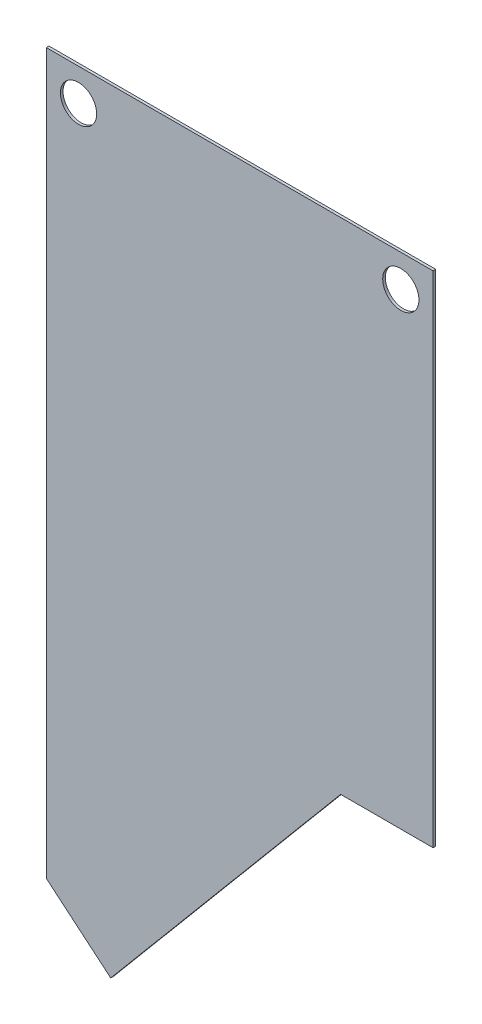
ISO-10303-21;
HEADER;
FILE_DESCRIPTION(('STEP AP214'),'2;1');
FILE_NAME('part.step','',(''),(''),'','','');
FILE_SCHEMA(('AUTOMOTIVE_DESIGN { 1 0 10303 214 1 1 1 1 }'));
ENDSEC;
DATA;
#1=APPLICATION_CONTEXT('core data for automotive mechanical design processes');
#2=APPLICATION_PROTOCOL_DEFINITION('international standard','automotive_design',2000,#1);
#3=PRODUCT_CONTEXT('',#1,'mechanical');
#4=PRODUCT('Part','Part','',(#3));
#5=PRODUCT_RELATED_PRODUCT_CATEGORY('part','',(#4));
#6=PRODUCT_DEFINITION_FORMATION('','',#4);
#7=PRODUCT_DEFINITION_CONTEXT('part definition',#1,'design');
#8=PRODUCT_DEFINITION('design','',#6,#7);
#9=PRODUCT_DEFINITION_SHAPE('','',#8);
#10=(LENGTH_UNIT() NAMED_UNIT(*) SI_UNIT(.MILLI.,.METRE.));
#11=(NAMED_UNIT(*) PLANE_ANGLE_UNIT() SI_UNIT($,.RADIAN.));
#12=(NAMED_UNIT(*) SI_UNIT($,.STERADIAN.) SOLID_ANGLE_UNIT());
#13=UNCERTAINTY_MEASURE_WITH_UNIT(LENGTH_MEASURE(1.E-05),#10,'distance_accuracy_value','');
#14=(GEOMETRIC_REPRESENTATION_CONTEXT(3) GLOBAL_UNCERTAINTY_ASSIGNED_CONTEXT((#13)) GLOBAL_UNIT_ASSIGNED_CONTEXT((#10,
#11,#12)) REPRESENTATION_CONTEXT('',''));
#15=CARTESIAN_POINT('',(0.,0.,0.));
#16=DIRECTION('',(0.,0.,1.));
#17=DIRECTION('',(1.,0.,0.));
#18=AXIS2_PLACEMENT_3D('',#15,#16,#17);
#19=CARTESIAN_POINT('',(-50.8,0.,2.1082));
#20=DIRECTION('',(1.,0.,0.));
#21=DIRECTION('',(0.,0.,-1.));
#22=AXIS2_PLACEMENT_3D('',#19,#20,#21);
#23=PLANE('',#22);
#24=DIRECTION('',(0.,-1.,0.));
#25=VECTOR('',#24,1.);
#26=CARTESIAN_POINT('',(-50.8,0.,0.));
#27=LINE('',#26,#25);
#28=CARTESIAN_POINT('',(-50.8,0.,0.));
#29=VERTEX_POINT('',#28);
#30=CARTESIAN_POINT('',(-50.8,-566.973738736194,0.));
#31=VERTEX_POINT('',#30);
#32=EDGE_CURVE('E81',#29,#31,#27,.T.);
#33=ORIENTED_EDGE('',*,*,#32,.T.);
#34=DIRECTION('',(0.,0.,-1.));
#35=VECTOR('',#34,1.);
#36=CARTESIAN_POINT('',(-50.8000000000001,-566.973738736194,2.1082));
#37=LINE('',#36,#35);
#38=CARTESIAN_POINT('',(-50.8000000000001,-566.973738736194,2.1082));
#39=VERTEX_POINT('',#38);
#40=EDGE_CURVE('E47',#39,#31,#37,.T.);
#41=ORIENTED_EDGE('',*,*,#40,.F.);
#42=DIRECTION('',(0.,-1.,0.));
#43=VECTOR('',#42,1.);
#44=CARTESIAN_POINT('',(-50.8,0.,2.1082));
#45=LINE('',#44,#43);
#46=CARTESIAN_POINT('',(-50.8,0.,2.1082));
#47=VERTEX_POINT('',#46);
#48=EDGE_CURVE('E76',#47,#39,#45,.T.);
#49=ORIENTED_EDGE('',*,*,#48,.F.);
#50=DIRECTION('',(0.,0.,-1.));
#51=VECTOR('',#50,1.);
#52=CARTESIAN_POINT('',(-50.8,0.,2.1082));
#53=LINE('',#52,#51);
#54=EDGE_CURVE('E40',#47,#29,#53,.T.);
#55=ORIENTED_EDGE('',*,*,#54,.T.);
#56=EDGE_LOOP('',(#33,#41,#49,#55));
#57=FACE_BOUND('',#56,.T.);
#58=ADVANCED_FACE('F33',(#57),#23,.F.);
#59=CARTESIAN_POINT('',(254.,0.,2.1082));
#60=DIRECTION('',(-1.,0.,0.));
#61=DIRECTION('',(0.,0.,1.));
#62=AXIS2_PLACEMENT_3D('',#59,#60,#61);
#63=PLANE('',#62);
#64=DIRECTION('',(0.,1.,0.));
#65=VECTOR('',#64,1.);
#66=CARTESIAN_POINT('',(254.,0.,2.1082));
#67=LINE('',#66,#65);
#68=CARTESIAN_POINT('',(254.,-393.699999999999,2.1082));
#69=VERTEX_POINT('',#68);
#70=CARTESIAN_POINT('',(254.,0.,2.1082));
#71=VERTEX_POINT('',#70);
#72=EDGE_CURVE('E93',#69,#71,#67,.T.);
#73=ORIENTED_EDGE('',*,*,#72,.F.);
#74=DIRECTION('',(0.,0.,-1.));
#75=VECTOR('',#74,1.);
#76=CARTESIAN_POINT('',(254.,-393.699999999999,2.1082));
#77=LINE('',#76,#75);
#78=CARTESIAN_POINT('',(254.,-393.699999999999,0.));
#79=VERTEX_POINT('',#78);
#80=EDGE_CURVE('E102',#69,#79,#77,.T.);
#81=ORIENTED_EDGE('',*,*,#80,.T.);
#82=DIRECTION('',(0.,1.,0.));
#83=VECTOR('',#82,1.);
#84=CARTESIAN_POINT('',(254.,0.,0.));
#85=LINE('',#84,#83);
#86=CARTESIAN_POINT('',(254.,0.,0.));
#87=VERTEX_POINT('',#86);
#88=EDGE_CURVE('E77',#79,#87,#85,.T.);
#89=ORIENTED_EDGE('',*,*,#88,.T.);
#90=DIRECTION('',(0.,0.,-1.));
#91=VECTOR('',#90,1.);
#92=CARTESIAN_POINT('',(254.,0.,2.1082));
#93=LINE('',#92,#91);
#94=EDGE_CURVE('E11',#71,#87,#93,.T.);
#95=ORIENTED_EDGE('',*,*,#94,.F.);
#96=EDGE_LOOP('',(#73,#81,#89,#95));
#97=FACE_BOUND('',#96,.T.);
#98=ADVANCED_FACE('F156',(#97),#63,.F.);
#99=CARTESIAN_POINT('',(-50.8,0.,2.1082));
#100=DIRECTION('',(0.,-1.,0.));
#101=DIRECTION('',(0.,0.,-1.));
#102=AXIS2_PLACEMENT_3D('',#99,#100,#101);
#103=PLANE('',#102);
#104=DIRECTION('',(-1.,0.,0.));
#105=VECTOR('',#104,1.);
#106=CARTESIAN_POINT('',(-50.8,0.,0.));
#107=LINE('',#106,#105);
#108=EDGE_CURVE('E68',#87,#29,#107,.T.);
#109=ORIENTED_EDGE('',*,*,#108,.T.);
#110=ORIENTED_EDGE('',*,*,#54,.F.);
#111=DIRECTION('',(-1.,0.,0.));
#112=VECTOR('',#111,1.);
#113=CARTESIAN_POINT('',(-50.8,0.,2.1082));
#114=LINE('',#113,#112);
#115=EDGE_CURVE('E56',#71,#47,#114,.T.);
#116=ORIENTED_EDGE('',*,*,#115,.F.);
#117=ORIENTED_EDGE('',*,*,#94,.T.);
#118=EDGE_LOOP('',(#109,#110,#116,#117));
#119=FACE_BOUND('',#118,.T.);
#120=ADVANCED_FACE('F70',(#119),#103,.F.);
#121=CARTESIAN_POINT('',(0.,0.,2.1082));
#122=DIRECTION('',(0.,0.,1.));
#123=DIRECTION('',(1.,0.,0.));
#124=AXIS2_PLACEMENT_3D('',#121,#122,#123);
#125=PLANE('',#124);
#126=DIRECTION('',(1.,0.,0.));
#127=VECTOR('',#126,1.);
#128=CARTESIAN_POINT('',(181.170170025414,-393.7,2.1082));
#129=LINE('',#128,#127);
#130=CARTESIAN_POINT('',(181.170170025414,-393.7,2.1082));
#131=VERTEX_POINT('',#130);
#132=EDGE_CURVE('E107',#131,#69,#129,.T.);
#133=ORIENTED_EDGE('',*,*,#132,.T.);
#134=ORIENTED_EDGE('',*,*,#72,.T.);
#135=ORIENTED_EDGE('',*,*,#115,.T.);
#136=ORIENTED_EDGE('',*,*,#48,.T.);
#137=DIRECTION('',(0.766044443118979,-0.642787609686539,0.));
#138=VECTOR('',#137,1.);
#139=CARTESIAN_POINT('',(-50.8000000000001,-566.973738736194,2.1082));
#140=LINE('',#139,#138);
#141=CARTESIAN_POINT('',(-1.54365409343882E-13,-609.6,2.1082));
#142=VERTEX_POINT('',#141);
#143=EDGE_CURVE('E118',#39,#142,#140,.T.);
#144=ORIENTED_EDGE('',*,*,#143,.T.);
#145=DIRECTION('',(0.642805431535631,0.766029488458695,0.));
#146=VECTOR('',#145,1.);
#147=CARTESIAN_POINT('',(-1.54365409343882E-13,-609.6,2.1082));
#148=LINE('',#147,#146);
#149=EDGE_CURVE('E125',#142,#131,#148,.T.);
#150=ORIENTED_EDGE('',*,*,#149,.T.);
#151=EDGE_LOOP('',(#133,#134,#135,#136,#144,#150));
#152=FACE_BOUND('',#151,.T.);
#153=CARTESIAN_POINT('',(228.6,-25.3999999999994,2.1082));
#154=DIRECTION('',(0.,0.,-1.));
#155=DIRECTION('',(-1.,0.,0.));
#156=AXIS2_PLACEMENT_3D('',#153,#154,#155);
#157=CIRCLE('',#156,14.2875);
#158=CARTESIAN_POINT('',(214.3125,-25.3999999999994,2.1082));
#159=VERTEX_POINT('',#158);
#160=EDGE_CURVE('E97',#159,#159,#157,.T.);
#161=ORIENTED_EDGE('',*,*,#160,.T.);
#162=EDGE_LOOP('',(#161));
#163=FACE_BOUND('',#162,.T.);
#164=CARTESIAN_POINT('',(-25.4,-25.4,2.1082));
#165=DIRECTION('',(0.,0.,-1.));
#166=DIRECTION('',(-1.,0.,0.));
#167=AXIS2_PLACEMENT_3D('',#164,#165,#166);
#168=CIRCLE('',#167,14.2875);
#169=CARTESIAN_POINT('',(-39.6875,-25.4,2.1082));
#170=VERTEX_POINT('',#169);
#171=EDGE_CURVE('E85',#170,#170,#168,.T.);
#172=ORIENTED_EDGE('',*,*,#171,.T.);
#173=EDGE_LOOP('',(#172));
#174=FACE_BOUND('',#173,.T.);
#175=ADVANCED_FACE('F130',(#152,#163,#174),#125,.T.);
#176=CARTESIAN_POINT('',(0.,0.,0.));
#177=DIRECTION('',(0.,0.,1.));
#178=DIRECTION('',(1.,0.,0.));
#179=AXIS2_PLACEMENT_3D('',#176,#177,#178);
#180=PLANE('',#179);
#181=CARTESIAN_POINT('',(228.6,-25.3999999999994,0.));
#182=DIRECTION('',(0.,0.,-1.));
#183=DIRECTION('',(-1.,0.,0.));
#184=AXIS2_PLACEMENT_3D('',#181,#182,#183);
#185=CIRCLE('',#184,14.2875);
#186=CARTESIAN_POINT('',(214.3125,-25.3999999999994,0.));
#187=VERTEX_POINT('',#186);
#188=EDGE_CURVE('E99',#187,#187,#185,.T.);
#189=ORIENTED_EDGE('',*,*,#188,.F.);
#190=EDGE_LOOP('',(#189));
#191=FACE_BOUND('',#190,.T.);
#192=CARTESIAN_POINT('',(-25.4,-25.4,0.));
#193=DIRECTION('',(0.,0.,-1.));
#194=DIRECTION('',(-1.,0.,0.));
#195=AXIS2_PLACEMENT_3D('',#192,#193,#194);
#196=CIRCLE('',#195,14.2875);
#197=CARTESIAN_POINT('',(-39.6875,-25.4,0.));
#198=VERTEX_POINT('',#197);
#199=EDGE_CURVE('E89',#198,#198,#196,.T.);
#200=ORIENTED_EDGE('',*,*,#199,.F.);
#201=EDGE_LOOP('',(#200));
#202=FACE_BOUND('',#201,.T.);
#203=ORIENTED_EDGE('',*,*,#88,.F.);
#204=DIRECTION('',(1.,0.,0.));
#205=VECTOR('',#204,1.);
#206=CARTESIAN_POINT('',(181.170170025414,-393.7,0.));
#207=LINE('',#206,#205);
#208=CARTESIAN_POINT('',(181.170170025414,-393.7,0.));
#209=VERTEX_POINT('',#208);
#210=EDGE_CURVE('E115',#209,#79,#207,.T.);
#211=ORIENTED_EDGE('',*,*,#210,.F.);
#212=DIRECTION('',(0.642805431535631,0.766029488458695,0.));
#213=VECTOR('',#212,1.);
#214=CARTESIAN_POINT('',(-1.54365409343882E-13,-609.6,0.));
#215=LINE('',#214,#213);
#216=CARTESIAN_POINT('',(-1.54365409343882E-13,-609.6,0.));
#217=VERTEX_POINT('',#216);
#218=EDGE_CURVE('E119',#217,#209,#215,.T.);
#219=ORIENTED_EDGE('',*,*,#218,.F.);
#220=DIRECTION('',(0.766044443118979,-0.642787609686539,0.));
#221=VECTOR('',#220,1.);
#222=CARTESIAN_POINT('',(-50.8000000000001,-566.973738736194,0.));
#223=LINE('',#222,#221);
#224=EDGE_CURVE('E84',#31,#217,#223,.T.);
#225=ORIENTED_EDGE('',*,*,#224,.F.);
#226=ORIENTED_EDGE('',*,*,#32,.F.);
#227=ORIENTED_EDGE('',*,*,#108,.F.);
#228=EDGE_LOOP('',(#203,#211,#219,#225,#226,#227));
#229=FACE_BOUND('',#228,.T.);
#230=ADVANCED_FACE('F82',(#191,#202,#229),#180,.F.);
#231=CARTESIAN_POINT('',(-25.4,-25.4,2.1082));
#232=DIRECTION('',(0.,0.,-1.));
#233=DIRECTION('',(-1.,0.,0.));
#234=AXIS2_PLACEMENT_3D('',#231,#232,#233);
#235=CYLINDRICAL_SURFACE('',#234,14.2875);
#236=ORIENTED_EDGE('',*,*,#171,.F.);
#237=EDGE_LOOP('',(#236));
#238=FACE_BOUND('',#237,.T.);
#239=ORIENTED_EDGE('',*,*,#199,.T.);
#240=EDGE_LOOP('',(#239));
#241=FACE_BOUND('',#240,.T.);
#242=ADVANCED_FACE('F166',(#238,#241),#235,.F.);
#243=CARTESIAN_POINT('',(228.6,-25.3999999999994,2.1082));
#244=DIRECTION('',(0.,0.,-1.));
#245=DIRECTION('',(-1.,0.,0.));
#246=AXIS2_PLACEMENT_3D('',#243,#244,#245);
#247=CYLINDRICAL_SURFACE('',#246,14.2875);
#248=ORIENTED_EDGE('',*,*,#160,.F.);
#249=EDGE_LOOP('',(#248));
#250=FACE_BOUND('',#249,.T.);
#251=ORIENTED_EDGE('',*,*,#188,.T.);
#252=EDGE_LOOP('',(#251));
#253=FACE_BOUND('',#252,.T.);
#254=ADVANCED_FACE('F172',(#250,#253),#247,.F.);
#255=CARTESIAN_POINT('',(181.170170025414,-393.7,2.1082));
#256=DIRECTION('',(0.,1.,0.));
#257=DIRECTION('',(-1.,0.,0.));
#258=AXIS2_PLACEMENT_3D('',#255,#256,#257);
#259=PLANE('',#258);
#260=ORIENTED_EDGE('',*,*,#210,.T.);
#261=ORIENTED_EDGE('',*,*,#80,.F.);
#262=ORIENTED_EDGE('',*,*,#132,.F.);
#263=DIRECTION('',(0.,0.,-1.));
#264=VECTOR('',#263,1.);
#265=CARTESIAN_POINT('',(181.170170025414,-393.7,2.1082));
#266=LINE('',#265,#264);
#267=EDGE_CURVE('E110',#131,#209,#266,.T.);
#268=ORIENTED_EDGE('',*,*,#267,.T.);
#269=EDGE_LOOP('',(#260,#261,#262,#268));
#270=FACE_BOUND('',#269,.T.);
#271=ADVANCED_FACE('F150',(#270),#259,.F.);
#272=CARTESIAN_POINT('',(-1.54365409343882E-13,-609.6,2.1082));
#273=DIRECTION('',(-0.766029488458695,0.642805431535631,0.));
#274=DIRECTION('',(-0.642805431535631,-0.766029488458695,0.));
#275=AXIS2_PLACEMENT_3D('',#272,#273,#274);
#276=PLANE('',#275);
#277=ORIENTED_EDGE('',*,*,#218,.T.);
#278=ORIENTED_EDGE('',*,*,#267,.F.);
#279=ORIENTED_EDGE('',*,*,#149,.F.);
#280=DIRECTION('',(0.,0.,-1.));
#281=VECTOR('',#280,1.);
#282=CARTESIAN_POINT('',(-1.54365409343882E-13,-609.6,2.1082));
#283=LINE('',#282,#281);
#284=EDGE_CURVE('E106',#142,#217,#283,.T.);
#285=ORIENTED_EDGE('',*,*,#284,.T.);
#286=EDGE_LOOP('',(#277,#278,#279,#285));
#287=FACE_BOUND('',#286,.T.);
#288=ADVANCED_FACE('F153',(#287),#276,.F.);
#289=CARTESIAN_POINT('',(-50.8000000000001,-566.973738736194,2.1082));
#290=DIRECTION('',(0.642787609686539,0.766044443118979,0.));
#291=DIRECTION('',(-0.766044443118979,0.642787609686539,0.));
#292=AXIS2_PLACEMENT_3D('',#289,#290,#291);
#293=PLANE('',#292);
#294=ORIENTED_EDGE('',*,*,#224,.T.);
#295=ORIENTED_EDGE('',*,*,#284,.F.);
#296=ORIENTED_EDGE('',*,*,#143,.F.);
#297=ORIENTED_EDGE('',*,*,#40,.T.);
#298=EDGE_LOOP('',(#294,#295,#296,#297));
#299=FACE_BOUND('',#298,.T.);
#300=ADVANCED_FACE('F137',(#299),#293,.F.);
#301=CLOSED_SHELL('',(#58,#98,#120,#175,#230,#242,#254,#271,#288,#300));
#302=MANIFOLD_SOLID_BREP('B2',#301);
#303=ADVANCED_BREP_SHAPE_REPRESENTATION('',(#18,#302),#14);
#304=SHAPE_DEFINITION_REPRESENTATION(#9,#303);
ENDSEC;
END-ISO-10303-21;
